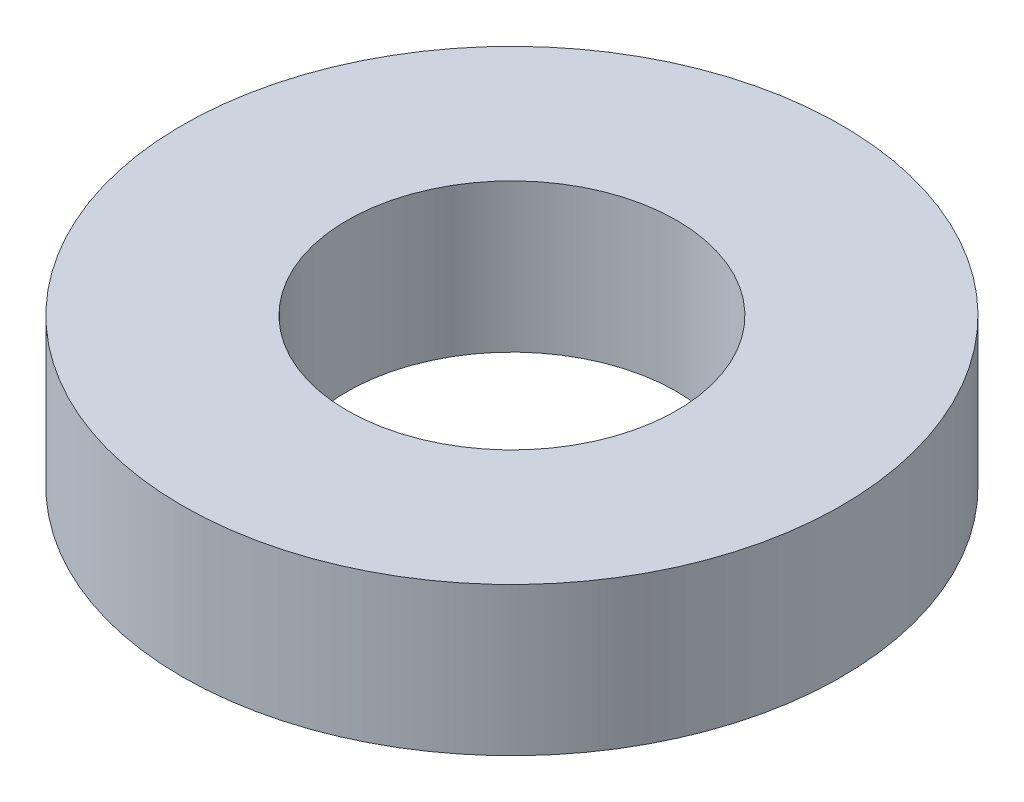
ISO-10303-21;
HEADER;
FILE_DESCRIPTION(('STEP AP214'),'2;1');
FILE_NAME('part.step','',(''),(''),'','','');
FILE_SCHEMA(('AUTOMOTIVE_DESIGN { 1 0 10303 214 1 1 1 1 }'));
ENDSEC;
DATA;
#1=APPLICATION_CONTEXT('core data for automotive mechanical design processes');
#2=APPLICATION_PROTOCOL_DEFINITION('international standard','automotive_design',2000,#1);
#3=PRODUCT_CONTEXT('',#1,'mechanical');
#4=PRODUCT('Part','Part','',(#3));
#5=PRODUCT_RELATED_PRODUCT_CATEGORY('part','',(#4));
#6=PRODUCT_DEFINITION_FORMATION('','',#4);
#7=PRODUCT_DEFINITION_CONTEXT('part definition',#1,'design');
#8=PRODUCT_DEFINITION('design','',#6,#7);
#9=PRODUCT_DEFINITION_SHAPE('','',#8);
#10=(LENGTH_UNIT() NAMED_UNIT(*) SI_UNIT(.MILLI.,.METRE.));
#11=(NAMED_UNIT(*) PLANE_ANGLE_UNIT() SI_UNIT($,.RADIAN.));
#12=(NAMED_UNIT(*) SI_UNIT($,.STERADIAN.) SOLID_ANGLE_UNIT());
#13=UNCERTAINTY_MEASURE_WITH_UNIT(LENGTH_MEASURE(1.E-05),#10,'distance_accuracy_value','');
#14=(GEOMETRIC_REPRESENTATION_CONTEXT(3) GLOBAL_UNCERTAINTY_ASSIGNED_CONTEXT((#13)) GLOBAL_UNIT_ASSIGNED_CONTEXT((#10,
#11,#12)) REPRESENTATION_CONTEXT('',''));
#15=CARTESIAN_POINT('',(0.,0.,0.));
#16=DIRECTION('',(0.,0.,1.));
#17=DIRECTION('',(1.,0.,0.));
#18=AXIS2_PLACEMENT_3D('',#15,#16,#17);
#19=CARTESIAN_POINT('',(0.,9.,0.));
#20=DIRECTION('',(0.,-1.,0.));
#21=DIRECTION('',(0.,0.,-1.));
#22=AXIS2_PLACEMENT_3D('',#19,#20,#21);
#23=CYLINDRICAL_SURFACE('',#22,20.);
#24=CARTESIAN_POINT('',(0.,9.,0.));
#25=DIRECTION('',(0.,1.,0.));
#26=DIRECTION('',(0.,0.,1.));
#27=AXIS2_PLACEMENT_3D('',#24,#25,#26);
#28=CIRCLE('',#27,20.);
#29=CARTESIAN_POINT('',(0.,9.,20.));
#30=VERTEX_POINT('',#29);
#31=EDGE_CURVE('E10',#30,#30,#28,.T.);
#32=ORIENTED_EDGE('',*,*,#31,.F.);
#33=EDGE_LOOP('',(#32));
#34=FACE_BOUND('',#33,.T.);
#35=CARTESIAN_POINT('',(0.,0.,0.));
#36=DIRECTION('',(0.,1.,0.));
#37=DIRECTION('',(0.,0.,1.));
#38=AXIS2_PLACEMENT_3D('',#35,#36,#37);
#39=CIRCLE('',#38,20.);
#40=CARTESIAN_POINT('',(0.,0.,20.));
#41=VERTEX_POINT('',#40);
#42=EDGE_CURVE('E37',#41,#41,#39,.T.);
#43=ORIENTED_EDGE('',*,*,#42,.T.);
#44=EDGE_LOOP('',(#43));
#45=FACE_BOUND('',#44,.T.);
#46=ADVANCED_FACE('F40',(#34,#45),#23,.T.);
#47=CARTESIAN_POINT('',(0.,9.,0.));
#48=DIRECTION('',(0.,1.,0.));
#49=DIRECTION('',(0.,0.,1.));
#50=AXIS2_PLACEMENT_3D('',#47,#48,#49);
#51=PLANE('',#50);
#52=CARTESIAN_POINT('',(0.,9.,0.));
#53=DIRECTION('',(0.,1.,0.));
#54=DIRECTION('',(0.,0.,1.));
#55=AXIS2_PLACEMENT_3D('',#52,#53,#54);
#56=CIRCLE('',#55,10.);
#57=CARTESIAN_POINT('',(0.,9.,10.));
#58=VERTEX_POINT('',#57);
#59=EDGE_CURVE('E50',#58,#58,#56,.T.);
#60=ORIENTED_EDGE('',*,*,#59,.F.);
#61=EDGE_LOOP('',(#60));
#62=FACE_BOUND('',#61,.T.);
#63=ORIENTED_EDGE('',*,*,#31,.T.);
#64=EDGE_LOOP('',(#63));
#65=FACE_BOUND('',#64,.T.);
#66=ADVANCED_FACE('F59',(#62,#65),#51,.T.);
#67=CARTESIAN_POINT('',(0.,0.,0.));
#68=DIRECTION('',(0.,1.,0.));
#69=DIRECTION('',(0.,0.,1.));
#70=AXIS2_PLACEMENT_3D('',#67,#68,#69);
#71=PLANE('',#70);
#72=CARTESIAN_POINT('',(0.,0.,0.));
#73=DIRECTION('',(0.,1.,0.));
#74=DIRECTION('',(0.,0.,1.));
#75=AXIS2_PLACEMENT_3D('',#72,#73,#74);
#76=CIRCLE('',#75,10.);
#77=CARTESIAN_POINT('',(0.,0.,10.));
#78=VERTEX_POINT('',#77);
#79=EDGE_CURVE('E47',#78,#78,#76,.T.);
#80=ORIENTED_EDGE('',*,*,#79,.T.);
#81=EDGE_LOOP('',(#80));
#82=FACE_BOUND('',#81,.T.);
#83=ORIENTED_EDGE('',*,*,#42,.F.);
#84=EDGE_LOOP('',(#83));
#85=FACE_BOUND('',#84,.T.);
#86=ADVANCED_FACE('F58',(#82,#85),#71,.F.);
#87=CARTESIAN_POINT('',(0.,9.,0.));
#88=DIRECTION('',(0.,-1.,0.));
#89=DIRECTION('',(0.,0.,-1.));
#90=AXIS2_PLACEMENT_3D('',#87,#88,#89);
#91=CYLINDRICAL_SURFACE('',#90,10.);
#92=ORIENTED_EDGE('',*,*,#59,.T.);
#93=EDGE_LOOP('',(#92));
#94=FACE_BOUND('',#93,.T.);
#95=ORIENTED_EDGE('',*,*,#79,.F.);
#96=EDGE_LOOP('',(#95));
#97=FACE_BOUND('',#96,.T.);
#98=ADVANCED_FACE('F54',(#94,#97),#91,.F.);
#99=CLOSED_SHELL('',(#46,#66,#86,#98));
#100=MANIFOLD_SOLID_BREP('B2',#99);
#101=ADVANCED_BREP_SHAPE_REPRESENTATION('',(#18,#100),#14);
#102=SHAPE_DEFINITION_REPRESENTATION(#9,#101);
ENDSEC;
END-ISO-10303-21;
